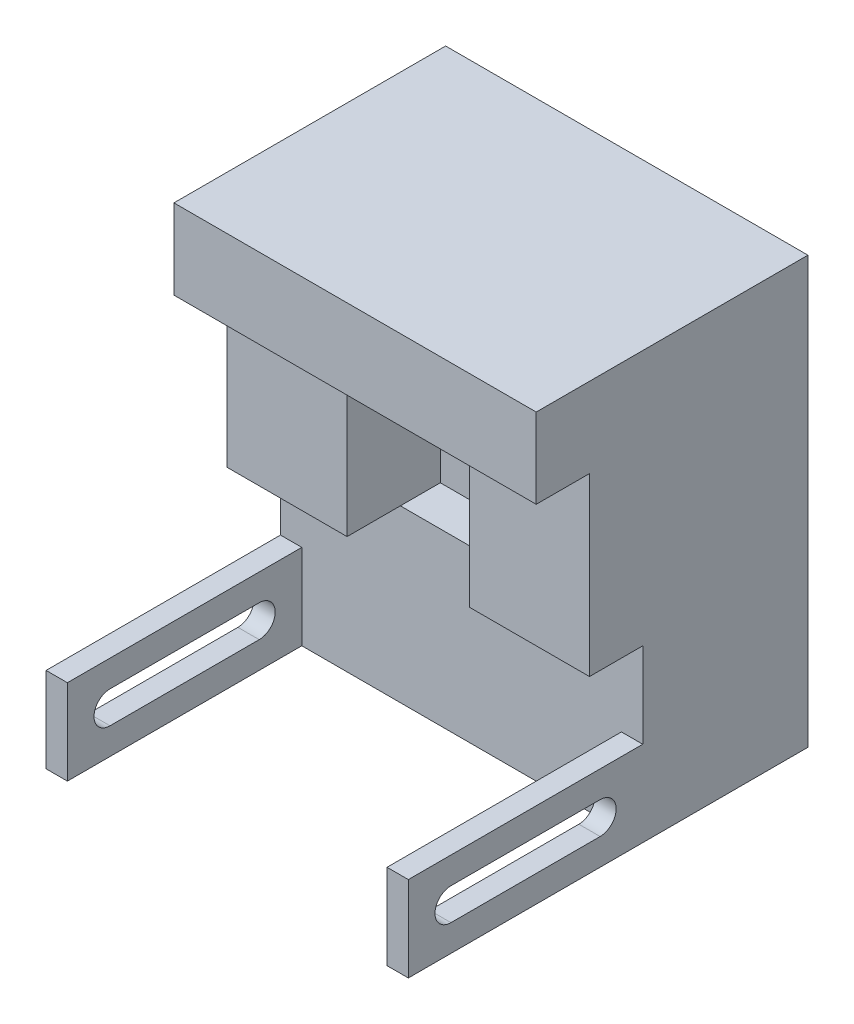
ISO-10303-21;
HEADER;
FILE_DESCRIPTION(('STEP AP214'),'2;1');
FILE_NAME('part.step','',(''),(''),'','','');
FILE_SCHEMA(('AUTOMOTIVE_DESIGN { 1 0 10303 214 1 1 1 1 }'));
ENDSEC;
DATA;
#1=APPLICATION_CONTEXT('core data for automotive mechanical design processes');
#2=APPLICATION_PROTOCOL_DEFINITION('international standard','automotive_design',2000,#1);
#3=PRODUCT_CONTEXT('',#1,'mechanical');
#4=PRODUCT('Part','Part','',(#3));
#5=PRODUCT_RELATED_PRODUCT_CATEGORY('part','',(#4));
#6=PRODUCT_DEFINITION_FORMATION('','',#4);
#7=PRODUCT_DEFINITION_CONTEXT('part definition',#1,'design');
#8=PRODUCT_DEFINITION('design','',#6,#7);
#9=PRODUCT_DEFINITION_SHAPE('','',#8);
#10=(LENGTH_UNIT() NAMED_UNIT(*) SI_UNIT(.MILLI.,.METRE.));
#11=(NAMED_UNIT(*) PLANE_ANGLE_UNIT() SI_UNIT($,.RADIAN.));
#12=(NAMED_UNIT(*) SI_UNIT($,.STERADIAN.) SOLID_ANGLE_UNIT());
#13=UNCERTAINTY_MEASURE_WITH_UNIT(LENGTH_MEASURE(1.E-05),#10,'distance_accuracy_value','');
#14=(GEOMETRIC_REPRESENTATION_CONTEXT(3) GLOBAL_UNCERTAINTY_ASSIGNED_CONTEXT((#13)) GLOBAL_UNIT_ASSIGNED_CONTEXT((#10,
#11,#12)) REPRESENTATION_CONTEXT('',''));
#15=CARTESIAN_POINT('',(0.,0.,0.));
#16=DIRECTION('',(0.,0.,1.));
#17=DIRECTION('',(1.,0.,0.));
#18=AXIS2_PLACEMENT_3D('',#15,#16,#17);
#19=CARTESIAN_POINT('',(0.,32.,23.5));
#20=DIRECTION('',(0.,1.,0.));
#21=DIRECTION('',(0.,0.,1.));
#22=AXIS2_PLACEMENT_3D('',#19,#20,#21);
#23=PLANE('',#22);
#24=DIRECTION('',(0.,0.,-1.));
#25=VECTOR('',#24,1.);
#26=CARTESIAN_POINT('',(0.,32.,41.));
#27=LINE('',#26,#25);
#28=CARTESIAN_POINT('',(0.,32.,41.));
#29=VERTEX_POINT('',#28);
#30=CARTESIAN_POINT('',(0.,32.,31.));
#31=VERTEX_POINT('',#30);
#32=EDGE_CURVE('E361',#29,#31,#27,.T.);
#33=ORIENTED_EDGE('',*,*,#32,.T.);
#34=DIRECTION('',(1.,0.,0.));
#35=VECTOR('',#34,1.);
#36=CARTESIAN_POINT('',(0.,32.,31.));
#37=LINE('',#36,#35);
#38=CARTESIAN_POINT('',(22.5,32.,31.));
#39=VERTEX_POINT('',#38);
#40=EDGE_CURVE('E329',#31,#39,#37,.T.);
#41=ORIENTED_EDGE('',*,*,#40,.T.);
#42=DIRECTION('',(0.,0.,-1.));
#43=VECTOR('',#42,1.);
#44=CARTESIAN_POINT('',(22.5,32.,41.));
#45=LINE('',#44,#43);
#46=CARTESIAN_POINT('',(22.5,32.,41.));
#47=VERTEX_POINT('',#46);
#48=EDGE_CURVE('E358',#47,#39,#45,.T.);
#49=ORIENTED_EDGE('',*,*,#48,.F.);
#50=DIRECTION('',(1.,0.,0.));
#51=VECTOR('',#50,1.);
#52=CARTESIAN_POINT('',(0.,32.,41.));
#53=LINE('',#52,#51);
#54=EDGE_CURVE('E355',#29,#47,#53,.T.);
#55=ORIENTED_EDGE('',*,*,#54,.F.);
#56=EDGE_LOOP('',(#33,#41,#49,#55));
#57=FACE_BOUND('',#56,.T.);
#58=ADVANCED_FACE('F40',(#57),#23,.F.);
#59=CARTESIAN_POINT('',(0.,65.,51.));
#60=DIRECTION('',(0.,1.,0.));
#61=DIRECTION('',(0.,0.,1.));
#62=AXIS2_PLACEMENT_3D('',#59,#60,#61);
#63=PLANE('',#62);
#64=DIRECTION('',(1.,0.,0.));
#65=VECTOR('',#64,1.);
#66=CARTESIAN_POINT('',(0.,65.,41.));
#67=LINE('',#66,#65);
#68=CARTESIAN_POINT('',(0.,65.,41.));
#69=VERTEX_POINT('',#68);
#70=CARTESIAN_POINT('',(22.5,65.,41.));
#71=VERTEX_POINT('',#70);
#72=EDGE_CURVE('E349',#69,#71,#67,.T.);
#73=ORIENTED_EDGE('',*,*,#72,.T.);
#74=DIRECTION('',(0.,0.,-1.));
#75=VECTOR('',#74,1.);
#76=CARTESIAN_POINT('',(22.5,65.,41.));
#77=LINE('',#76,#75);
#78=CARTESIAN_POINT('',(22.5,65.,23.5));
#79=VERTEX_POINT('',#78);
#80=EDGE_CURVE('E364',#71,#79,#77,.T.);
#81=ORIENTED_EDGE('',*,*,#80,.T.);
#82=DIRECTION('',(1.,0.,0.));
#83=VECTOR('',#82,1.);
#84=CARTESIAN_POINT('',(0.,65.,23.5));
#85=LINE('',#84,#83);
#86=CARTESIAN_POINT('',(45.5,65.,23.5));
#87=VERTEX_POINT('',#86);
#88=EDGE_CURVE('E389',#79,#87,#85,.T.);
#89=ORIENTED_EDGE('',*,*,#88,.T.);
#90=DIRECTION('',(0.,0.,-1.));
#91=VECTOR('',#90,1.);
#92=CARTESIAN_POINT('',(45.5,65.,41.));
#93=LINE('',#92,#91);
#94=CARTESIAN_POINT('',(45.5,65.,41.));
#95=VERTEX_POINT('',#94);
#96=EDGE_CURVE('E383',#95,#87,#93,.T.);
#97=ORIENTED_EDGE('',*,*,#96,.F.);
#98=DIRECTION('',(1.,0.,0.));
#99=VECTOR('',#98,1.);
#100=CARTESIAN_POINT('',(0.,65.,41.));
#101=LINE('',#100,#99);
#102=CARTESIAN_POINT('',(68.,65.,41.));
#103=VERTEX_POINT('',#102);
#104=EDGE_CURVE('E367',#95,#103,#101,.T.);
#105=ORIENTED_EDGE('',*,*,#104,.T.);
#106=DIRECTION('',(0.,0.,-1.));
#107=VECTOR('',#106,1.);
#108=CARTESIAN_POINT('',(68.,65.,51.));
#109=LINE('',#108,#107);
#110=CARTESIAN_POINT('',(68.,65.,51.));
#111=VERTEX_POINT('',#110);
#112=EDGE_CURVE('E425',#111,#103,#109,.T.);
#113=ORIENTED_EDGE('',*,*,#112,.F.);
#114=DIRECTION('',(1.,0.,0.));
#115=VECTOR('',#114,1.);
#116=CARTESIAN_POINT('',(0.,65.,51.));
#117=LINE('',#116,#115);
#118=CARTESIAN_POINT('',(0.,65.,51.));
#119=VERTEX_POINT('',#118);
#120=EDGE_CURVE('E399',#119,#111,#117,.T.);
#121=ORIENTED_EDGE('',*,*,#120,.F.);
#122=DIRECTION('',(0.,0.,-1.));
#123=VECTOR('',#122,1.);
#124=CARTESIAN_POINT('',(0.,65.,51.));
#125=LINE('',#124,#123);
#126=EDGE_CURVE('E411',#119,#69,#125,.T.);
#127=ORIENTED_EDGE('',*,*,#126,.T.);
#128=EDGE_LOOP('',(#73,#81,#89,#97,#105,#113,#121,#127));
#129=FACE_BOUND('',#128,.T.);
#130=ADVANCED_FACE('F42',(#129),#63,.F.);
#131=CARTESIAN_POINT('',(68.,0.,51.));
#132=DIRECTION('',(-1.,0.,0.));
#133=DIRECTION('',(0.,0.,1.));
#134=AXIS2_PLACEMENT_3D('',#131,#132,#133);
#135=PLANE('',#134);
#136=DIRECTION('',(0.,0.,-1.));
#137=VECTOR('',#136,1.);
#138=CARTESIAN_POINT('',(68.,5.00000000000001,67.));
#139=LINE('',#138,#137);
#140=CARTESIAN_POINT('',(68.,5.00000000000001,67.));
#141=VERTEX_POINT('',#140);
#142=CARTESIAN_POINT('',(68.,5.00000000000001,39.));
#143=VERTEX_POINT('',#142);
#144=EDGE_CURVE('E236',#141,#143,#139,.T.);
#145=ORIENTED_EDGE('',*,*,#144,.F.);
#146=CARTESIAN_POINT('',(68.,8.00000000000001,67.));
#147=DIRECTION('',(1.,0.,0.));
#148=DIRECTION('',(0.,1.,0.));
#149=AXIS2_PLACEMENT_3D('',#146,#147,#148);
#150=CIRCLE('',#149,3.);
#151=CARTESIAN_POINT('',(68.,11.,67.));
#152=VERTEX_POINT('',#151);
#153=EDGE_CURVE('E55',#152,#141,#150,.T.);
#154=ORIENTED_EDGE('',*,*,#153,.F.);
#155=DIRECTION('',(0.,0.,1.));
#156=VECTOR('',#155,1.);
#157=CARTESIAN_POINT('',(68.,11.,67.));
#158=LINE('',#157,#156);
#159=CARTESIAN_POINT('',(68.,11.,39.));
#160=VERTEX_POINT('',#159);
#161=EDGE_CURVE('E244',#160,#152,#158,.T.);
#162=ORIENTED_EDGE('',*,*,#161,.F.);
#163=CARTESIAN_POINT('',(68.,8.00000000000001,39.));
#164=DIRECTION('',(1.,0.,0.));
#165=DIRECTION('',(0.,1.,0.));
#166=AXIS2_PLACEMENT_3D('',#163,#164,#165);
#167=CIRCLE('',#166,3.);
#168=EDGE_CURVE('E226',#143,#160,#167,.T.);
#169=ORIENTED_EDGE('',*,*,#168,.F.);
#170=EDGE_LOOP('',(#145,#154,#162,#169));
#171=FACE_BOUND('',#170,.T.);
#172=DIRECTION('',(0.,1.,0.));
#173=VECTOR('',#172,1.);
#174=CARTESIAN_POINT('',(68.,0.,0.));
#175=LINE('',#174,#173);
#176=CARTESIAN_POINT('',(68.,0.,0.));
#177=VERTEX_POINT('',#176);
#178=CARTESIAN_POINT('',(68.,80.,0.));
#179=VERTEX_POINT('',#178);
#180=EDGE_CURVE('E398',#177,#179,#175,.T.);
#181=ORIENTED_EDGE('',*,*,#180,.T.);
#182=DIRECTION('',(0.,0.,-1.));
#183=VECTOR('',#182,1.);
#184=CARTESIAN_POINT('',(68.,80.,51.));
#185=LINE('',#184,#183);
#186=CARTESIAN_POINT('',(68.,80.,51.));
#187=VERTEX_POINT('',#186);
#188=EDGE_CURVE('E423',#187,#179,#185,.T.);
#189=ORIENTED_EDGE('',*,*,#188,.F.);
#190=DIRECTION('',(0.,1.,0.));
#191=VECTOR('',#190,1.);
#192=CARTESIAN_POINT('',(68.,0.,51.));
#193=LINE('',#192,#191);
#194=EDGE_CURVE('E402',#111,#187,#193,.T.);
#195=ORIENTED_EDGE('',*,*,#194,.F.);
#196=ORIENTED_EDGE('',*,*,#112,.T.);
#197=DIRECTION('',(0.,1.,0.));
#198=VECTOR('',#197,1.);
#199=CARTESIAN_POINT('',(68.,0.,41.));
#200=LINE('',#199,#198);
#201=CARTESIAN_POINT('',(68.,32.,41.));
#202=VERTEX_POINT('',#201);
#203=EDGE_CURVE('E373',#202,#103,#200,.T.);
#204=ORIENTED_EDGE('',*,*,#203,.F.);
#205=DIRECTION('',(0.,0.,-1.));
#206=VECTOR('',#205,1.);
#207=CARTESIAN_POINT('',(68.,32.,41.));
#208=LINE('',#207,#206);
#209=CARTESIAN_POINT('',(68.,32.,31.));
#210=VERTEX_POINT('',#209);
#211=EDGE_CURVE('E376',#202,#210,#208,.T.);
#212=ORIENTED_EDGE('',*,*,#211,.T.);
#213=DIRECTION('',(0.,1.,0.));
#214=VECTOR('',#213,1.);
#215=CARTESIAN_POINT('',(68.,0.,31.));
#216=LINE('',#215,#214);
#217=CARTESIAN_POINT('',(68.,16.,31.));
#218=VERTEX_POINT('',#217);
#219=EDGE_CURVE('E326',#218,#210,#216,.T.);
#220=ORIENTED_EDGE('',*,*,#219,.F.);
#221=DIRECTION('',(0.,0.,-1.));
#222=VECTOR('',#221,1.);
#223=CARTESIAN_POINT('',(68.,16.,75.));
#224=LINE('',#223,#222);
#225=CARTESIAN_POINT('',(68.,16.,75.));
#226=VERTEX_POINT('',#225);
#227=EDGE_CURVE('E286',#226,#218,#224,.T.);
#228=ORIENTED_EDGE('',*,*,#227,.F.);
#229=DIRECTION('',(0.,1.,0.));
#230=VECTOR('',#229,1.);
#231=CARTESIAN_POINT('',(68.,0.,75.));
#232=LINE('',#231,#230);
#233=CARTESIAN_POINT('',(68.,0.,75.));
#234=VERTEX_POINT('',#233);
#235=EDGE_CURVE('E284',#234,#226,#232,.T.);
#236=ORIENTED_EDGE('',*,*,#235,.F.);
#237=DIRECTION('',(0.,0.,-1.));
#238=VECTOR('',#237,1.);
#239=CARTESIAN_POINT('',(68.,0.,75.));
#240=LINE('',#239,#238);
#241=EDGE_CURVE('E289',#234,#177,#240,.T.);
#242=ORIENTED_EDGE('',*,*,#241,.T.);
#243=EDGE_LOOP('',(#181,#189,#195,#196,#204,#212,#220,#228,#236,#242));
#244=FACE_BOUND('',#243,.T.);
#245=ADVANCED_FACE('F241',(#171,#244),#135,.F.);
#246=CARTESIAN_POINT('',(0.,80.,51.));
#247=DIRECTION('',(0.,1.,0.));
#248=DIRECTION('',(0.,0.,1.));
#249=AXIS2_PLACEMENT_3D('',#246,#247,#248);
#250=PLANE('',#249);
#251=DIRECTION('',(1.,0.,0.));
#252=VECTOR('',#251,1.);
#253=CARTESIAN_POINT('',(0.,80.,0.));
#254=LINE('',#253,#252);
#255=CARTESIAN_POINT('',(0.,80.,0.));
#256=VERTEX_POINT('',#255);
#257=EDGE_CURVE('E414',#256,#179,#254,.T.);
#258=ORIENTED_EDGE('',*,*,#257,.F.);
#259=DIRECTION('',(0.,0.,-1.));
#260=VECTOR('',#259,1.);
#261=CARTESIAN_POINT('',(0.,80.,51.));
#262=LINE('',#261,#260);
#263=CARTESIAN_POINT('',(0.,80.,51.));
#264=VERTEX_POINT('',#263);
#265=EDGE_CURVE('E421',#264,#256,#262,.T.);
#266=ORIENTED_EDGE('',*,*,#265,.F.);
#267=DIRECTION('',(1.,0.,0.));
#268=VECTOR('',#267,1.);
#269=CARTESIAN_POINT('',(0.,80.,51.));
#270=LINE('',#269,#268);
#271=EDGE_CURVE('E405',#264,#187,#270,.T.);
#272=ORIENTED_EDGE('',*,*,#271,.T.);
#273=ORIENTED_EDGE('',*,*,#188,.T.);
#274=EDGE_LOOP('',(#258,#266,#272,#273));
#275=FACE_BOUND('',#274,.T.);
#276=ADVANCED_FACE('F515',(#275),#250,.T.);
#277=CARTESIAN_POINT('',(0.,0.,51.));
#278=DIRECTION('',(-1.,0.,0.));
#279=DIRECTION('',(0.,0.,1.));
#280=AXIS2_PLACEMENT_3D('',#277,#278,#279);
#281=PLANE('',#280);
#282=CARTESIAN_POINT('',(0.,8.,67.));
#283=DIRECTION('',(1.,0.,0.));
#284=DIRECTION('',(0.,1.,0.));
#285=AXIS2_PLACEMENT_3D('',#282,#283,#284);
#286=CIRCLE('',#285,3.);
#287=CARTESIAN_POINT('',(0.,11.,67.));
#288=VERTEX_POINT('',#287);
#289=CARTESIAN_POINT('',(0.,5.,67.));
#290=VERTEX_POINT('',#289);
#291=EDGE_CURVE('E246',#288,#290,#286,.T.);
#292=ORIENTED_EDGE('',*,*,#291,.T.);
#293=DIRECTION('',(0.,0.,-1.));
#294=VECTOR('',#293,1.);
#295=CARTESIAN_POINT('',(0.,5.,67.));
#296=LINE('',#295,#294);
#297=CARTESIAN_POINT('',(0.,5.,39.));
#298=VERTEX_POINT('',#297);
#299=EDGE_CURVE('E252',#290,#298,#296,.T.);
#300=ORIENTED_EDGE('',*,*,#299,.T.);
#301=CARTESIAN_POINT('',(0.,8.,39.));
#302=DIRECTION('',(1.,0.,0.));
#303=DIRECTION('',(0.,1.,0.));
#304=AXIS2_PLACEMENT_3D('',#301,#302,#303);
#305=CIRCLE('',#304,3.);
#306=CARTESIAN_POINT('',(0.,11.,39.));
#307=VERTEX_POINT('',#306);
#308=EDGE_CURVE('E63',#298,#307,#305,.T.);
#309=ORIENTED_EDGE('',*,*,#308,.T.);
#310=DIRECTION('',(0.,0.,1.));
#311=VECTOR('',#310,1.);
#312=CARTESIAN_POINT('',(0.,11.,67.));
#313=LINE('',#312,#311);
#314=EDGE_CURVE('E256',#307,#288,#313,.T.);
#315=ORIENTED_EDGE('',*,*,#314,.T.);
#316=EDGE_LOOP('',(#292,#300,#309,#315));
#317=FACE_BOUND('',#316,.T.);
#318=DIRECTION('',(0.,1.,0.));
#319=VECTOR('',#318,1.);
#320=CARTESIAN_POINT('',(0.,0.,0.));
#321=LINE('',#320,#319);
#322=CARTESIAN_POINT('',(0.,0.,0.));
#323=VERTEX_POINT('',#322);
#324=EDGE_CURVE('E403',#323,#256,#321,.T.);
#325=ORIENTED_EDGE('',*,*,#324,.F.);
#326=DIRECTION('',(0.,0.,-1.));
#327=VECTOR('',#326,1.);
#328=CARTESIAN_POINT('',(0.,0.,75.));
#329=LINE('',#328,#327);
#330=CARTESIAN_POINT('',(0.,0.,75.));
#331=VERTEX_POINT('',#330);
#332=EDGE_CURVE('E311',#331,#323,#329,.T.);
#333=ORIENTED_EDGE('',*,*,#332,.F.);
#334=DIRECTION('',(0.,1.,0.));
#335=VECTOR('',#334,1.);
#336=CARTESIAN_POINT('',(0.,0.,75.));
#337=LINE('',#336,#335);
#338=CARTESIAN_POINT('',(0.,16.,75.));
#339=VERTEX_POINT('',#338);
#340=EDGE_CURVE('E304',#331,#339,#337,.T.);
#341=ORIENTED_EDGE('',*,*,#340,.T.);
#342=DIRECTION('',(0.,0.,-1.));
#343=VECTOR('',#342,1.);
#344=CARTESIAN_POINT('',(0.,16.,75.));
#345=LINE('',#344,#343);
#346=CARTESIAN_POINT('',(0.,16.,31.));
#347=VERTEX_POINT('',#346);
#348=EDGE_CURVE('E314',#339,#347,#345,.T.);
#349=ORIENTED_EDGE('',*,*,#348,.T.);
#350=DIRECTION('',(0.,1.,0.));
#351=VECTOR('',#350,1.);
#352=CARTESIAN_POINT('',(0.,0.,31.));
#353=LINE('',#352,#351);
#354=EDGE_CURVE('E332',#347,#31,#353,.T.);
#355=ORIENTED_EDGE('',*,*,#354,.T.);
#356=ORIENTED_EDGE('',*,*,#32,.F.);
#357=DIRECTION('',(0.,1.,0.));
#358=VECTOR('',#357,1.);
#359=CARTESIAN_POINT('',(0.,0.,41.));
#360=LINE('',#359,#358);
#361=EDGE_CURVE('E352',#29,#69,#360,.T.);
#362=ORIENTED_EDGE('',*,*,#361,.T.);
#363=ORIENTED_EDGE('',*,*,#126,.F.);
#364=DIRECTION('',(0.,1.,0.));
#365=VECTOR('',#364,1.);
#366=CARTESIAN_POINT('',(0.,0.,51.));
#367=LINE('',#366,#365);
#368=EDGE_CURVE('E408',#119,#264,#367,.T.);
#369=ORIENTED_EDGE('',*,*,#368,.T.);
#370=ORIENTED_EDGE('',*,*,#265,.T.);
#371=EDGE_LOOP('',(#325,#333,#341,#349,#355,#356,#362,#363,#369,#370));
#372=FACE_BOUND('',#371,.T.);
#373=ADVANCED_FACE('F495',(#317,#372),#281,.T.);
#374=CARTESIAN_POINT('',(0.,0.,51.));
#375=DIRECTION('',(0.,0.,1.));
#376=DIRECTION('',(1.,0.,0.));
#377=AXIS2_PLACEMENT_3D('',#374,#375,#376);
#378=PLANE('',#377);
#379=ORIENTED_EDGE('',*,*,#120,.T.);
#380=ORIENTED_EDGE('',*,*,#194,.T.);
#381=ORIENTED_EDGE('',*,*,#271,.F.);
#382=ORIENTED_EDGE('',*,*,#368,.F.);
#383=EDGE_LOOP('',(#379,#380,#381,#382));
#384=FACE_BOUND('',#383,.T.);
#385=ADVANCED_FACE('F470',(#384),#378,.T.);
#386=CARTESIAN_POINT('',(0.,0.,0.));
#387=DIRECTION('',(0.,0.,1.));
#388=DIRECTION('',(1.,0.,0.));
#389=AXIS2_PLACEMENT_3D('',#386,#387,#388);
#390=PLANE('',#389);
#391=ORIENTED_EDGE('',*,*,#180,.F.);
#392=DIRECTION('',(1.,0.,0.));
#393=VECTOR('',#392,1.);
#394=CARTESIAN_POINT('',(0.,0.,0.));
#395=LINE('',#394,#393);
#396=EDGE_CURVE('E319',#323,#177,#395,.T.);
#397=ORIENTED_EDGE('',*,*,#396,.F.);
#398=ORIENTED_EDGE('',*,*,#324,.T.);
#399=ORIENTED_EDGE('',*,*,#257,.T.);
#400=EDGE_LOOP('',(#391,#397,#398,#399));
#401=FACE_BOUND('',#400,.T.);
#402=ADVANCED_FACE('F462',(#401),#390,.F.);
#403=DIRECTION('',(0.,0.,-1.));
#404=VECTOR('',#403,1.);
#405=CARTESIAN_POINT('',(45.5,32.,41.));
#406=LINE('',#405,#404);
#407=CARTESIAN_POINT('',(45.5,32.,41.));
#408=VERTEX_POINT('',#407);
#409=CARTESIAN_POINT('',(45.5,32.,31.));
#410=VERTEX_POINT('',#409);
#411=EDGE_CURVE('E380',#408,#410,#406,.T.);
#412=ORIENTED_EDGE('',*,*,#411,.T.);
#413=EDGE_CURVE('E333',#410,#210,#37,.T.);
#414=ORIENTED_EDGE('',*,*,#413,.T.);
#415=ORIENTED_EDGE('',*,*,#211,.F.);
#416=DIRECTION('',(1.,0.,0.));
#417=VECTOR('',#416,1.);
#418=CARTESIAN_POINT('',(0.,32.,41.));
#419=LINE('',#418,#417);
#420=EDGE_CURVE('E371',#408,#202,#419,.T.);
#421=ORIENTED_EDGE('',*,*,#420,.F.);
#422=EDGE_LOOP('',(#412,#414,#415,#421));
#423=FACE_BOUND('',#422,.T.);
#424=ADVANCED_FACE('F453',(#423),#23,.F.);
#425=CARTESIAN_POINT('',(0.,0.,23.5));
#426=DIRECTION('',(0.,0.,1.));
#427=DIRECTION('',(1.,0.,0.));
#428=AXIS2_PLACEMENT_3D('',#425,#426,#427);
#429=PLANE('',#428);
#430=DIRECTION('',(0.,-1.,0.));
#431=VECTOR('',#430,1.);
#432=CARTESIAN_POINT('',(45.5,0.,23.5));
#433=LINE('',#432,#431);
#434=CARTESIAN_POINT('',(45.5,32.,23.5));
#435=VERTEX_POINT('',#434);
#436=EDGE_CURVE('E386',#87,#435,#433,.T.);
#437=ORIENTED_EDGE('',*,*,#436,.F.);
#438=ORIENTED_EDGE('',*,*,#88,.F.);
#439=DIRECTION('',(0.,-1.,0.));
#440=VECTOR('',#439,1.);
#441=CARTESIAN_POINT('',(22.5,0.,23.5));
#442=LINE('',#441,#440);
#443=CARTESIAN_POINT('',(22.5,32.,23.5));
#444=VERTEX_POINT('',#443);
#445=EDGE_CURVE('E392',#79,#444,#442,.T.);
#446=ORIENTED_EDGE('',*,*,#445,.T.);
#447=DIRECTION('',(1.,0.,0.));
#448=VECTOR('',#447,1.);
#449=CARTESIAN_POINT('',(0.,32.,23.5));
#450=LINE('',#449,#448);
#451=EDGE_CURVE('E395',#444,#435,#450,.T.);
#452=ORIENTED_EDGE('',*,*,#451,.T.);
#453=EDGE_LOOP('',(#437,#438,#446,#452));
#454=FACE_BOUND('',#453,.T.);
#455=ADVANCED_FACE('F461',(#454),#429,.T.);
#456=CARTESIAN_POINT('',(45.5,0.,41.));
#457=DIRECTION('',(1.,0.,0.));
#458=DIRECTION('',(0.,0.,-1.));
#459=AXIS2_PLACEMENT_3D('',#456,#457,#458);
#460=PLANE('',#459);
#461=ORIENTED_EDGE('',*,*,#436,.T.);
#462=EDGE_CURVE('E379',#410,#435,#406,.T.);
#463=ORIENTED_EDGE('',*,*,#462,.F.);
#464=ORIENTED_EDGE('',*,*,#411,.F.);
#465=DIRECTION('',(0.,-1.,0.));
#466=VECTOR('',#465,1.);
#467=CARTESIAN_POINT('',(45.5,0.,41.));
#468=LINE('',#467,#466);
#469=EDGE_CURVE('E369',#95,#408,#468,.T.);
#470=ORIENTED_EDGE('',*,*,#469,.F.);
#471=ORIENTED_EDGE('',*,*,#96,.T.);
#472=EDGE_LOOP('',(#461,#463,#464,#470,#471));
#473=FACE_BOUND('',#472,.T.);
#474=ADVANCED_FACE('F468',(#473),#460,.F.);
#475=CARTESIAN_POINT('',(0.,0.,41.));
#476=DIRECTION('',(0.,0.,1.));
#477=DIRECTION('',(1.,0.,0.));
#478=AXIS2_PLACEMENT_3D('',#475,#476,#477);
#479=PLANE('',#478);
#480=ORIENTED_EDGE('',*,*,#104,.F.);
#481=ORIENTED_EDGE('',*,*,#469,.T.);
#482=ORIENTED_EDGE('',*,*,#420,.T.);
#483=ORIENTED_EDGE('',*,*,#203,.T.);
#484=EDGE_LOOP('',(#480,#481,#482,#483));
#485=FACE_BOUND('',#484,.T.);
#486=ADVANCED_FACE('F508',(#485),#479,.T.);
#487=CARTESIAN_POINT('',(22.5,0.,41.));
#488=DIRECTION('',(1.,0.,0.));
#489=DIRECTION('',(0.,1.,0.));
#490=AXIS2_PLACEMENT_3D('',#487,#488,#489);
#491=PLANE('',#490);
#492=ORIENTED_EDGE('',*,*,#48,.T.);
#493=EDGE_CURVE('E357',#39,#444,#45,.T.);
#494=ORIENTED_EDGE('',*,*,#493,.T.);
#495=ORIENTED_EDGE('',*,*,#445,.F.);
#496=ORIENTED_EDGE('',*,*,#80,.F.);
#497=DIRECTION('',(0.,-1.,0.));
#498=VECTOR('',#497,1.);
#499=CARTESIAN_POINT('',(22.5,0.,41.));
#500=LINE('',#499,#498);
#501=EDGE_CURVE('E344',#71,#47,#500,.T.);
#502=ORIENTED_EDGE('',*,*,#501,.T.);
#503=EDGE_LOOP('',(#492,#494,#495,#496,#502));
#504=FACE_BOUND('',#503,.T.);
#505=ADVANCED_FACE('F488',(#504),#491,.T.);
#506=CARTESIAN_POINT('',(0.,0.,41.));
#507=DIRECTION('',(0.,0.,1.));
#508=DIRECTION('',(1.,0.,0.));
#509=AXIS2_PLACEMENT_3D('',#506,#507,#508);
#510=PLANE('',#509);
#511=ORIENTED_EDGE('',*,*,#501,.F.);
#512=ORIENTED_EDGE('',*,*,#72,.F.);
#513=ORIENTED_EDGE('',*,*,#361,.F.);
#514=ORIENTED_EDGE('',*,*,#54,.T.);
#515=EDGE_LOOP('',(#511,#512,#513,#514));
#516=FACE_BOUND('',#515,.T.);
#517=ADVANCED_FACE('F493',(#516),#510,.T.);
#518=CARTESIAN_POINT('',(0.,32.,31.));
#519=DIRECTION('',(0.,1.,0.));
#520=DIRECTION('',(0.,0.,1.));
#521=AXIS2_PLACEMENT_3D('',#518,#519,#520);
#522=PLANE('',#521);
#523=EDGE_CURVE('E328',#39,#410,#37,.T.);
#524=ORIENTED_EDGE('',*,*,#523,.T.);
#525=ORIENTED_EDGE('',*,*,#462,.T.);
#526=ORIENTED_EDGE('',*,*,#451,.F.);
#527=ORIENTED_EDGE('',*,*,#493,.F.);
#528=EDGE_LOOP('',(#524,#525,#526,#527));
#529=FACE_BOUND('',#528,.T.);
#530=ADVANCED_FACE('F483',(#529),#522,.T.);
#531=CARTESIAN_POINT('',(0.,0.,31.));
#532=DIRECTION('',(0.,1.,0.));
#533=DIRECTION('',(0.,0.,1.));
#534=AXIS2_PLACEMENT_3D('',#531,#532,#533);
#535=PLANE('',#534);
#536=ORIENTED_EDGE('',*,*,#396,.T.);
#537=ORIENTED_EDGE('',*,*,#241,.F.);
#538=DIRECTION('',(1.,0.,0.));
#539=VECTOR('',#538,1.);
#540=CARTESIAN_POINT('',(0.,0.,75.));
#541=LINE('',#540,#539);
#542=CARTESIAN_POINT('',(64.,0.,75.));
#543=VERTEX_POINT('',#542);
#544=EDGE_CURVE('E282',#543,#234,#541,.T.);
#545=ORIENTED_EDGE('',*,*,#544,.F.);
#546=DIRECTION('',(0.,0.,-1.));
#547=VECTOR('',#546,1.);
#548=CARTESIAN_POINT('',(64.,0.,75.));
#549=LINE('',#548,#547);
#550=CARTESIAN_POINT('',(64.,0.,31.));
#551=VERTEX_POINT('',#550);
#552=EDGE_CURVE('E292',#543,#551,#549,.T.);
#553=ORIENTED_EDGE('',*,*,#552,.T.);
#554=DIRECTION('',(1.,0.,0.));
#555=VECTOR('',#554,1.);
#556=CARTESIAN_POINT('',(0.,0.,31.));
#557=LINE('',#556,#555);
#558=CARTESIAN_POINT('',(4.,0.,31.));
#559=VERTEX_POINT('',#558);
#560=EDGE_CURVE('E342',#559,#551,#557,.T.);
#561=ORIENTED_EDGE('',*,*,#560,.F.);
#562=DIRECTION('',(0.,0.,-1.));
#563=VECTOR('',#562,1.);
#564=CARTESIAN_POINT('',(4.,0.,75.));
#565=LINE('',#564,#563);
#566=CARTESIAN_POINT('',(4.,0.,75.));
#567=VERTEX_POINT('',#566);
#568=EDGE_CURVE('E309',#567,#559,#565,.T.);
#569=ORIENTED_EDGE('',*,*,#568,.F.);
#570=DIRECTION('',(1.,0.,0.));
#571=VECTOR('',#570,1.);
#572=CARTESIAN_POINT('',(0.,0.,75.));
#573=LINE('',#572,#571);
#574=EDGE_CURVE('E307',#331,#567,#573,.T.);
#575=ORIENTED_EDGE('',*,*,#574,.F.);
#576=ORIENTED_EDGE('',*,*,#332,.T.);
#577=EDGE_LOOP('',(#536,#537,#545,#553,#561,#569,#575,#576));
#578=FACE_BOUND('',#577,.T.);
#579=ADVANCED_FACE('F520',(#578),#535,.F.);
#580=CARTESIAN_POINT('',(0.,0.,31.));
#581=DIRECTION('',(0.,0.,1.));
#582=DIRECTION('',(1.,0.,0.));
#583=AXIS2_PLACEMENT_3D('',#580,#581,#582);
#584=PLANE('',#583);
#585=DIRECTION('',(0.,-1.,0.));
#586=VECTOR('',#585,1.);
#587=CARTESIAN_POINT('',(64.,0.,31.));
#588=LINE('',#587,#586);
#589=CARTESIAN_POINT('',(64.,16.,31.));
#590=VERTEX_POINT('',#589);
#591=EDGE_CURVE('E320',#590,#551,#588,.T.);
#592=ORIENTED_EDGE('',*,*,#591,.F.);
#593=DIRECTION('',(-1.,0.,0.));
#594=VECTOR('',#593,1.);
#595=CARTESIAN_POINT('',(0.,16.,31.));
#596=LINE('',#595,#594);
#597=EDGE_CURVE('E323',#218,#590,#596,.T.);
#598=ORIENTED_EDGE('',*,*,#597,.F.);
#599=ORIENTED_EDGE('',*,*,#219,.T.);
#600=ORIENTED_EDGE('',*,*,#413,.F.);
#601=ORIENTED_EDGE('',*,*,#523,.F.);
#602=ORIENTED_EDGE('',*,*,#40,.F.);
#603=ORIENTED_EDGE('',*,*,#354,.F.);
#604=DIRECTION('',(1.,0.,0.));
#605=VECTOR('',#604,1.);
#606=CARTESIAN_POINT('',(0.,16.,31.));
#607=LINE('',#606,#605);
#608=CARTESIAN_POINT('',(4.,16.,31.));
#609=VERTEX_POINT('',#608);
#610=EDGE_CURVE('E336',#347,#609,#607,.T.);
#611=ORIENTED_EDGE('',*,*,#610,.T.);
#612=DIRECTION('',(0.,-1.,0.));
#613=VECTOR('',#612,1.);
#614=CARTESIAN_POINT('',(4.,0.,31.));
#615=LINE('',#614,#613);
#616=EDGE_CURVE('E339',#609,#559,#615,.T.);
#617=ORIENTED_EDGE('',*,*,#616,.T.);
#618=ORIENTED_EDGE('',*,*,#560,.T.);
#619=EDGE_LOOP('',(#592,#598,#599,#600,#601,#602,#603,#611,#617,#618));
#620=FACE_BOUND('',#619,.T.);
#621=ADVANCED_FACE('F500',(#620),#584,.T.);
#622=CARTESIAN_POINT('',(4.,0.,75.));
#623=DIRECTION('',(1.,0.,0.));
#624=DIRECTION('',(0.,1.,0.));
#625=AXIS2_PLACEMENT_3D('',#622,#623,#624);
#626=PLANE('',#625);
#627=CARTESIAN_POINT('',(4.,8.,67.));
#628=DIRECTION('',(1.,0.,0.));
#629=DIRECTION('',(0.,1.,0.));
#630=AXIS2_PLACEMENT_3D('',#627,#628,#629);
#631=CIRCLE('',#630,3.);
#632=CARTESIAN_POINT('',(4.,11.,67.));
#633=VERTEX_POINT('',#632);
#634=CARTESIAN_POINT('',(4.,5.,67.));
#635=VERTEX_POINT('',#634);
#636=EDGE_CURVE('E274',#633,#635,#631,.T.);
#637=ORIENTED_EDGE('',*,*,#636,.F.);
#638=DIRECTION('',(0.,0.,1.));
#639=VECTOR('',#638,1.);
#640=CARTESIAN_POINT('',(4.,11.,75.));
#641=LINE('',#640,#639);
#642=CARTESIAN_POINT('',(4.,11.,39.));
#643=VERTEX_POINT('',#642);
#644=EDGE_CURVE('E272',#643,#633,#641,.T.);
#645=ORIENTED_EDGE('',*,*,#644,.F.);
#646=CARTESIAN_POINT('',(4.,8.,39.));
#647=DIRECTION('',(1.,0.,0.));
#648=DIRECTION('',(0.,1.,0.));
#649=AXIS2_PLACEMENT_3D('',#646,#647,#648);
#650=CIRCLE('',#649,3.);
#651=CARTESIAN_POINT('',(4.,5.,39.));
#652=VERTEX_POINT('',#651);
#653=EDGE_CURVE('E270',#652,#643,#650,.T.);
#654=ORIENTED_EDGE('',*,*,#653,.F.);
#655=DIRECTION('',(0.,0.,-1.));
#656=VECTOR('',#655,1.);
#657=CARTESIAN_POINT('',(4.,5.,75.));
#658=LINE('',#657,#656);
#659=EDGE_CURVE('E262',#635,#652,#658,.T.);
#660=ORIENTED_EDGE('',*,*,#659,.F.);
#661=EDGE_LOOP('',(#637,#645,#654,#660));
#662=FACE_BOUND('',#661,.T.);
#663=ORIENTED_EDGE('',*,*,#568,.T.);
#664=ORIENTED_EDGE('',*,*,#616,.F.);
#665=DIRECTION('',(0.,0.,-1.));
#666=VECTOR('',#665,1.);
#667=CARTESIAN_POINT('',(4.,16.,75.));
#668=LINE('',#667,#666);
#669=CARTESIAN_POINT('',(4.,16.,75.));
#670=VERTEX_POINT('',#669);
#671=EDGE_CURVE('E317',#670,#609,#668,.T.);
#672=ORIENTED_EDGE('',*,*,#671,.F.);
#673=DIRECTION('',(0.,-1.,0.));
#674=VECTOR('',#673,1.);
#675=CARTESIAN_POINT('',(4.,0.,75.));
#676=LINE('',#675,#674);
#677=EDGE_CURVE('E298',#670,#567,#676,.T.);
#678=ORIENTED_EDGE('',*,*,#677,.T.);
#679=EDGE_LOOP('',(#663,#664,#672,#678));
#680=FACE_BOUND('',#679,.T.);
#681=ADVANCED_FACE('F553',(#662,#680),#626,.T.);
#682=CARTESIAN_POINT('',(0.,16.,75.));
#683=DIRECTION('',(0.,1.,0.));
#684=DIRECTION('',(0.,0.,1.));
#685=AXIS2_PLACEMENT_3D('',#682,#683,#684);
#686=PLANE('',#685);
#687=ORIENTED_EDGE('',*,*,#671,.T.);
#688=ORIENTED_EDGE('',*,*,#610,.F.);
#689=ORIENTED_EDGE('',*,*,#348,.F.);
#690=DIRECTION('',(1.,0.,0.));
#691=VECTOR('',#690,1.);
#692=CARTESIAN_POINT('',(0.,16.,75.));
#693=LINE('',#692,#691);
#694=EDGE_CURVE('E301',#339,#670,#693,.T.);
#695=ORIENTED_EDGE('',*,*,#694,.T.);
#696=EDGE_LOOP('',(#687,#688,#689,#695));
#697=FACE_BOUND('',#696,.T.);
#698=ADVANCED_FACE('F528',(#697),#686,.T.);
#699=CARTESIAN_POINT('',(0.,0.,75.));
#700=DIRECTION('',(0.,0.,1.));
#701=DIRECTION('',(1.,0.,0.));
#702=AXIS2_PLACEMENT_3D('',#699,#700,#701);
#703=PLANE('',#702);
#704=ORIENTED_EDGE('',*,*,#677,.F.);
#705=ORIENTED_EDGE('',*,*,#694,.F.);
#706=ORIENTED_EDGE('',*,*,#340,.F.);
#707=ORIENTED_EDGE('',*,*,#574,.T.);
#708=EDGE_LOOP('',(#704,#705,#706,#707));
#709=FACE_BOUND('',#708,.T.);
#710=ADVANCED_FACE('F526',(#709),#703,.T.);
#711=CARTESIAN_POINT('',(0.,16.,75.));
#712=DIRECTION('',(0.,-1.,0.));
#713=DIRECTION('',(0.,0.,-1.));
#714=AXIS2_PLACEMENT_3D('',#711,#712,#713);
#715=PLANE('',#714);
#716=ORIENTED_EDGE('',*,*,#597,.T.);
#717=DIRECTION('',(0.,0.,-1.));
#718=VECTOR('',#717,1.);
#719=CARTESIAN_POINT('',(64.,16.,75.));
#720=LINE('',#719,#718);
#721=CARTESIAN_POINT('',(64.,16.,75.));
#722=VERTEX_POINT('',#721);
#723=EDGE_CURVE('E295',#722,#590,#720,.T.);
#724=ORIENTED_EDGE('',*,*,#723,.F.);
#725=DIRECTION('',(-1.,0.,0.));
#726=VECTOR('',#725,1.);
#727=CARTESIAN_POINT('',(0.,16.,75.));
#728=LINE('',#727,#726);
#729=EDGE_CURVE('E277',#226,#722,#728,.T.);
#730=ORIENTED_EDGE('',*,*,#729,.F.);
#731=ORIENTED_EDGE('',*,*,#227,.T.);
#732=EDGE_LOOP('',(#716,#724,#730,#731));
#733=FACE_BOUND('',#732,.T.);
#734=ADVANCED_FACE('F536',(#733),#715,.F.);
#735=CARTESIAN_POINT('',(64.,0.,75.));
#736=DIRECTION('',(1.,0.,0.));
#737=DIRECTION('',(0.,0.,-1.));
#738=AXIS2_PLACEMENT_3D('',#735,#736,#737);
#739=PLANE('',#738);
#740=DIRECTION('',(0.,0.,1.));
#741=VECTOR('',#740,1.);
#742=CARTESIAN_POINT('',(64.,11.,75.));
#743=LINE('',#742,#741);
#744=CARTESIAN_POINT('',(64.,11.,39.));
#745=VERTEX_POINT('',#744);
#746=CARTESIAN_POINT('',(64.,11.,67.));
#747=VERTEX_POINT('',#746);
#748=EDGE_CURVE('E48',#745,#747,#743,.T.);
#749=ORIENTED_EDGE('',*,*,#748,.T.);
#750=CARTESIAN_POINT('',(64.,8.00000000000001,67.));
#751=DIRECTION('',(1.,0.,0.));
#752=DIRECTION('',(0.,0.,-1.));
#753=AXIS2_PLACEMENT_3D('',#750,#751,#752);
#754=CIRCLE('',#753,3.);
#755=CARTESIAN_POINT('',(64.,5.00000000000001,67.));
#756=VERTEX_POINT('',#755);
#757=EDGE_CURVE('E11',#747,#756,#754,.T.);
#758=ORIENTED_EDGE('',*,*,#757,.T.);
#759=DIRECTION('',(0.,0.,-1.));
#760=VECTOR('',#759,1.);
#761=CARTESIAN_POINT('',(64.,5.00000000000001,75.));
#762=LINE('',#761,#760);
#763=CARTESIAN_POINT('',(64.,5.00000000000001,39.));
#764=VERTEX_POINT('',#763);
#765=EDGE_CURVE('E428',#756,#764,#762,.T.);
#766=ORIENTED_EDGE('',*,*,#765,.T.);
#767=CARTESIAN_POINT('',(64.,8.00000000000001,39.));
#768=DIRECTION('',(1.,0.,0.));
#769=DIRECTION('',(0.,0.,-1.));
#770=AXIS2_PLACEMENT_3D('',#767,#768,#769);
#771=CIRCLE('',#770,3.);
#772=EDGE_CURVE('E229',#764,#745,#771,.T.);
#773=ORIENTED_EDGE('',*,*,#772,.T.);
#774=EDGE_LOOP('',(#749,#758,#766,#773));
#775=FACE_BOUND('',#774,.T.);
#776=ORIENTED_EDGE('',*,*,#591,.T.);
#777=ORIENTED_EDGE('',*,*,#552,.F.);
#778=DIRECTION('',(0.,-1.,0.));
#779=VECTOR('',#778,1.);
#780=CARTESIAN_POINT('',(64.,0.,75.));
#781=LINE('',#780,#779);
#782=EDGE_CURVE('E280',#722,#543,#781,.T.);
#783=ORIENTED_EDGE('',*,*,#782,.F.);
#784=ORIENTED_EDGE('',*,*,#723,.T.);
#785=EDGE_LOOP('',(#776,#777,#783,#784));
#786=FACE_BOUND('',#785,.T.);
#787=ADVANCED_FACE('F432',(#775,#786),#739,.F.);
#788=CARTESIAN_POINT('',(0.,0.,75.));
#789=DIRECTION('',(0.,0.,1.));
#790=DIRECTION('',(1.,0.,0.));
#791=AXIS2_PLACEMENT_3D('',#788,#789,#790);
#792=PLANE('',#791);
#793=ORIENTED_EDGE('',*,*,#729,.T.);
#794=ORIENTED_EDGE('',*,*,#782,.T.);
#795=ORIENTED_EDGE('',*,*,#544,.T.);
#796=ORIENTED_EDGE('',*,*,#235,.T.);
#797=EDGE_LOOP('',(#793,#794,#795,#796));
#798=FACE_BOUND('',#797,.T.);
#799=ADVANCED_FACE('F538',(#798),#792,.T.);
#800=CARTESIAN_POINT('',(0.,5.,67.));
#801=DIRECTION('',(0.,-1.,0.));
#802=DIRECTION('',(1.,0.,0.));
#803=AXIS2_PLACEMENT_3D('',#800,#801,#802);
#804=PLANE('',#803);
#805=DIRECTION('',(1.,0.,0.));
#806=VECTOR('',#805,1.);
#807=CARTESIAN_POINT('',(0.,5.,67.));
#808=LINE('',#807,#806);
#809=EDGE_CURVE('E238',#756,#141,#808,.T.);
#810=ORIENTED_EDGE('',*,*,#809,.T.);
#811=ORIENTED_EDGE('',*,*,#144,.T.);
#812=DIRECTION('',(1.,0.,0.));
#813=VECTOR('',#812,1.);
#814=CARTESIAN_POINT('',(0.,5.,39.));
#815=LINE('',#814,#813);
#816=EDGE_CURVE('E221',#764,#143,#815,.T.);
#817=ORIENTED_EDGE('',*,*,#816,.F.);
#818=ORIENTED_EDGE('',*,*,#765,.F.);
#819=EDGE_LOOP('',(#810,#811,#817,#818));
#820=FACE_BOUND('',#819,.T.);
#821=ADVANCED_FACE('F237',(#820),#804,.F.);
#822=CARTESIAN_POINT('',(0.,8.,39.));
#823=DIRECTION('',(1.,0.,0.));
#824=DIRECTION('',(0.,1.,0.));
#825=AXIS2_PLACEMENT_3D('',#822,#823,#824);
#826=CYLINDRICAL_SURFACE('',#825,3.);
#827=ORIENTED_EDGE('',*,*,#816,.T.);
#828=ORIENTED_EDGE('',*,*,#168,.T.);
#829=DIRECTION('',(1.,0.,0.));
#830=VECTOR('',#829,1.);
#831=CARTESIAN_POINT('',(0.,11.,39.));
#832=LINE('',#831,#830);
#833=EDGE_CURVE('E266',#745,#160,#832,.T.);
#834=ORIENTED_EDGE('',*,*,#833,.F.);
#835=ORIENTED_EDGE('',*,*,#772,.F.);
#836=EDGE_LOOP('',(#827,#828,#834,#835));
#837=FACE_BOUND('',#836,.T.);
#838=ADVANCED_FACE('F223',(#837),#826,.F.);
#839=CARTESIAN_POINT('',(0.,11.,67.));
#840=DIRECTION('',(0.,1.,0.));
#841=DIRECTION('',(-1.,0.,0.));
#842=AXIS2_PLACEMENT_3D('',#839,#840,#841);
#843=PLANE('',#842);
#844=ORIENTED_EDGE('',*,*,#833,.T.);
#845=ORIENTED_EDGE('',*,*,#161,.T.);
#846=DIRECTION('',(1.,0.,0.));
#847=VECTOR('',#846,1.);
#848=CARTESIAN_POINT('',(0.,11.,67.));
#849=LINE('',#848,#847);
#850=EDGE_CURVE('E263',#747,#152,#849,.T.);
#851=ORIENTED_EDGE('',*,*,#850,.F.);
#852=ORIENTED_EDGE('',*,*,#748,.F.);
#853=EDGE_LOOP('',(#844,#845,#851,#852));
#854=FACE_BOUND('',#853,.T.);
#855=ADVANCED_FACE('F436',(#854),#843,.F.);
#856=CARTESIAN_POINT('',(0.,8.,67.));
#857=DIRECTION('',(1.,0.,0.));
#858=DIRECTION('',(0.,1.,0.));
#859=AXIS2_PLACEMENT_3D('',#856,#857,#858);
#860=CYLINDRICAL_SURFACE('',#859,3.);
#861=ORIENTED_EDGE('',*,*,#850,.T.);
#862=ORIENTED_EDGE('',*,*,#153,.T.);
#863=ORIENTED_EDGE('',*,*,#809,.F.);
#864=ORIENTED_EDGE('',*,*,#757,.F.);
#865=EDGE_LOOP('',(#861,#862,#863,#864));
#866=FACE_BOUND('',#865,.T.);
#867=ADVANCED_FACE('F437',(#866),#860,.F.);
#868=ORIENTED_EDGE('',*,*,#636,.T.);
#869=EDGE_CURVE('E233',#290,#635,#808,.T.);
#870=ORIENTED_EDGE('',*,*,#869,.F.);
#871=ORIENTED_EDGE('',*,*,#291,.F.);
#872=EDGE_CURVE('E259',#288,#633,#849,.T.);
#873=ORIENTED_EDGE('',*,*,#872,.T.);
#874=EDGE_LOOP('',(#868,#870,#871,#873));
#875=FACE_BOUND('',#874,.T.);
#876=ADVANCED_FACE('F439',(#875),#860,.F.);
#877=ORIENTED_EDGE('',*,*,#644,.T.);
#878=ORIENTED_EDGE('',*,*,#872,.F.);
#879=ORIENTED_EDGE('',*,*,#314,.F.);
#880=EDGE_CURVE('E264',#307,#643,#832,.T.);
#881=ORIENTED_EDGE('',*,*,#880,.T.);
#882=EDGE_LOOP('',(#877,#878,#879,#881));
#883=FACE_BOUND('',#882,.T.);
#884=ADVANCED_FACE('F445',(#883),#843,.F.);
#885=ORIENTED_EDGE('',*,*,#653,.T.);
#886=ORIENTED_EDGE('',*,*,#880,.F.);
#887=ORIENTED_EDGE('',*,*,#308,.F.);
#888=EDGE_CURVE('E232',#298,#652,#815,.T.);
#889=ORIENTED_EDGE('',*,*,#888,.T.);
#890=EDGE_LOOP('',(#885,#886,#887,#889));
#891=FACE_BOUND('',#890,.T.);
#892=ADVANCED_FACE('F636',(#891),#826,.F.);
#893=ORIENTED_EDGE('',*,*,#659,.T.);
#894=ORIENTED_EDGE('',*,*,#888,.F.);
#895=ORIENTED_EDGE('',*,*,#299,.F.);
#896=ORIENTED_EDGE('',*,*,#869,.T.);
#897=EDGE_LOOP('',(#893,#894,#895,#896));
#898=FACE_BOUND('',#897,.T.);
#899=ADVANCED_FACE('F544',(#898),#804,.F.);
#900=CLOSED_SHELL('',(#58,#130,#245,#276,#373,#385,#402,#424,#455,#474,#486,#505,#517,#530,#579,
#621,#681,#698,#710,#734,#787,#799,#821,#838,#855,#867,#876,#884,#892,#899));
#901=MANIFOLD_SOLID_BREP('B2',#900);
#902=ADVANCED_BREP_SHAPE_REPRESENTATION('',(#18,#901),#14);
#903=SHAPE_DEFINITION_REPRESENTATION(#9,#902);
ENDSEC;
END-ISO-10303-21;
